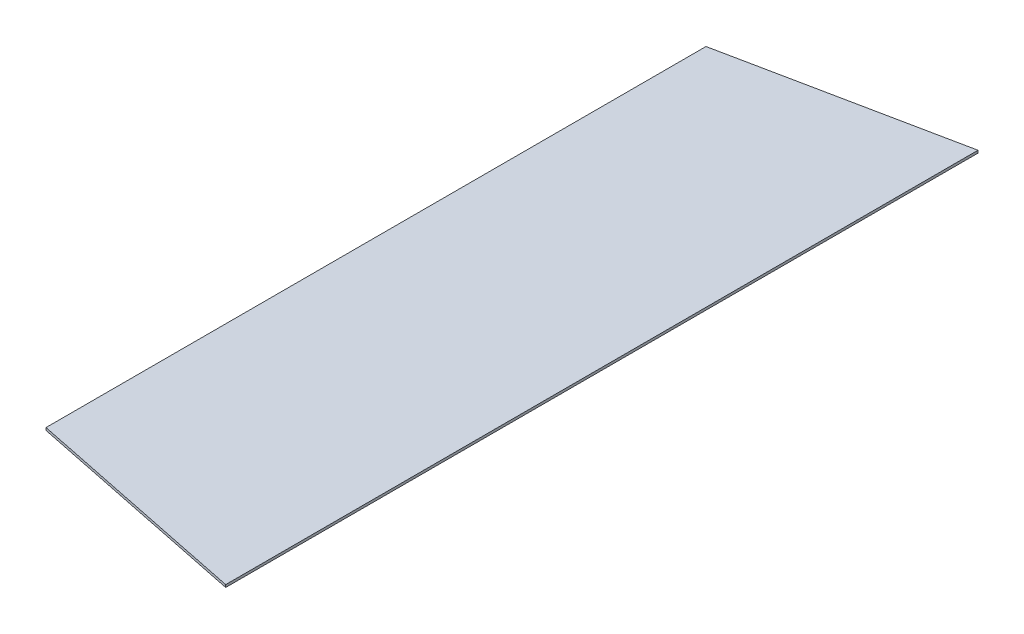
ISO-10303-21;
HEADER;
FILE_DESCRIPTION(('STEP AP214'),'2;1');
FILE_NAME('part.step','',(''),(''),'','','');
FILE_SCHEMA(('AUTOMOTIVE_DESIGN { 1 0 10303 214 1 1 1 1 }'));
ENDSEC;
DATA;
#1=APPLICATION_CONTEXT('core data for automotive mechanical design processes');
#2=APPLICATION_PROTOCOL_DEFINITION('international standard','automotive_design',2000,#1);
#3=PRODUCT_CONTEXT('',#1,'mechanical');
#4=PRODUCT('Part','Part','',(#3));
#5=PRODUCT_RELATED_PRODUCT_CATEGORY('part','',(#4));
#6=PRODUCT_DEFINITION_FORMATION('','',#4);
#7=PRODUCT_DEFINITION_CONTEXT('part definition',#1,'design');
#8=PRODUCT_DEFINITION('design','',#6,#7);
#9=PRODUCT_DEFINITION_SHAPE('','',#8);
#10=(LENGTH_UNIT() NAMED_UNIT(*) SI_UNIT(.MILLI.,.METRE.));
#11=(NAMED_UNIT(*) PLANE_ANGLE_UNIT() SI_UNIT($,.RADIAN.));
#12=(NAMED_UNIT(*) SI_UNIT($,.STERADIAN.) SOLID_ANGLE_UNIT());
#13=UNCERTAINTY_MEASURE_WITH_UNIT(LENGTH_MEASURE(1.E-05),#10,'distance_accuracy_value','');
#14=(GEOMETRIC_REPRESENTATION_CONTEXT(3) GLOBAL_UNCERTAINTY_ASSIGNED_CONTEXT((#13)) GLOBAL_UNIT_ASSIGNED_CONTEXT((#10,
#11,#12)) REPRESENTATION_CONTEXT('',''));
#15=CARTESIAN_POINT('',(0.,0.,0.));
#16=DIRECTION('',(0.,0.,1.));
#17=DIRECTION('',(1.,0.,0.));
#18=AXIS2_PLACEMENT_3D('',#15,#16,#17);
#19=CARTESIAN_POINT('',(-0.600000000000001,0.,1.49897790055249));
#20=DIRECTION('',(0.,1.,0.));
#21=DIRECTION('',(0.,0.,-1.));
#22=AXIS2_PLACEMENT_3D('',#19,#20,#21);
#23=PLANE('',#22);
#24=DIRECTION('',(0.979739078021312,0.,0.200278154070655));
#25=VECTOR('',#24,1.);
#26=CARTESIAN_POINT('',(-1.5,0.,1.315));
#27=LINE('',#26,#25);
#28=CARTESIAN_POINT('',(-1.5,0.,1.315));
#29=VERTEX_POINT('',#28);
#30=CARTESIAN_POINT('',(-0.600000000000001,0.,1.49897790055249));
#31=VERTEX_POINT('',#30);
#32=EDGE_CURVE('E11',#29,#31,#27,.T.);
#33=ORIENTED_EDGE('',*,*,#32,.T.);
#34=DIRECTION('',(0.,0.,-1.));
#35=VECTOR('',#34,1.);
#36=CARTESIAN_POINT('',(-0.600000000000001,0.,1.49897790055249));
#37=LINE('',#36,#35);
#38=CARTESIAN_POINT('',(-0.600000000000001,0.,-1.49897790055249));
#39=VERTEX_POINT('',#38);
#40=EDGE_CURVE('E61',#31,#39,#37,.T.);
#41=ORIENTED_EDGE('',*,*,#40,.T.);
#42=DIRECTION('',(-0.979739078021312,0.,0.200278154070655));
#43=VECTOR('',#42,1.);
#44=CARTESIAN_POINT('',(-0.6,0.,-1.49897790055249));
#45=LINE('',#44,#43);
#46=CARTESIAN_POINT('',(-1.5,0.,-1.315));
#47=VERTEX_POINT('',#46);
#48=EDGE_CURVE('E85',#39,#47,#45,.T.);
#49=ORIENTED_EDGE('',*,*,#48,.T.);
#50=DIRECTION('',(0.,0.,1.));
#51=VECTOR('',#50,1.);
#52=CARTESIAN_POINT('',(-1.5,0.,-1.315));
#53=LINE('',#52,#51);
#54=EDGE_CURVE('E24',#47,#29,#53,.T.);
#55=ORIENTED_EDGE('',*,*,#54,.T.);
#56=EDGE_LOOP('',(#33,#41,#49,#55));
#57=FACE_BOUND('',#56,.T.);
#58=ADVANCED_FACE('F17',(#57),#23,.T.);
#59=CARTESIAN_POINT('',(-1.5,0.29,-1.315));
#60=DIRECTION('',(1.,0.,0.));
#61=DIRECTION('',(0.,0.,-1.));
#62=AXIS2_PLACEMENT_3D('',#59,#60,#61);
#63=PLANE('',#62);
#64=ORIENTED_EDGE('',*,*,#54,.F.);
#65=DIRECTION('',(0.,-1.,0.));
#66=VECTOR('',#65,1.);
#67=CARTESIAN_POINT('',(-1.5,0.,-1.315));
#68=LINE('',#67,#66);
#69=CARTESIAN_POINT('',(-1.5,-0.0100000000000001,-1.315));
#70=VERTEX_POINT('',#69);
#71=EDGE_CURVE('E83',#47,#70,#68,.T.);
#72=ORIENTED_EDGE('',*,*,#71,.T.);
#73=DIRECTION('',(0.,0.,1.));
#74=VECTOR('',#73,1.);
#75=CARTESIAN_POINT('',(-1.5,-0.01,-1.315));
#76=LINE('',#75,#74);
#77=CARTESIAN_POINT('',(-1.5,-0.01,1.315));
#78=VERTEX_POINT('',#77);
#79=EDGE_CURVE('E79',#70,#78,#76,.T.);
#80=ORIENTED_EDGE('',*,*,#79,.T.);
#81=DIRECTION('',(0.,-1.,0.));
#82=VECTOR('',#81,1.);
#83=CARTESIAN_POINT('',(-1.5,0.,1.315));
#84=LINE('',#83,#82);
#85=EDGE_CURVE('E68',#29,#78,#84,.T.);
#86=ORIENTED_EDGE('',*,*,#85,.F.);
#87=EDGE_LOOP('',(#64,#72,#80,#86));
#88=FACE_BOUND('',#87,.T.);
#89=ADVANCED_FACE('F89',(#88),#63,.F.);
#90=CARTESIAN_POINT('',(-0.595,0.29,-1.5));
#91=DIRECTION('',(0.200278154070655,0.,0.979739078021312));
#92=DIRECTION('',(0.979739078021312,0.,-0.200278154070655));
#93=AXIS2_PLACEMENT_3D('',#90,#91,#92);
#94=PLANE('',#93);
#95=ORIENTED_EDGE('',*,*,#48,.F.);
#96=DIRECTION('',(0.,1.,0.));
#97=VECTOR('',#96,1.);
#98=CARTESIAN_POINT('',(-0.600000000000001,-0.01,-1.49897790055249));
#99=LINE('',#98,#97);
#100=CARTESIAN_POINT('',(-0.600000000000001,-0.01,-1.49897790055249));
#101=VERTEX_POINT('',#100);
#102=EDGE_CURVE('E81',#101,#39,#99,.T.);
#103=ORIENTED_EDGE('',*,*,#102,.F.);
#104=DIRECTION('',(0.979739078021194,0.,-0.200278154071234));
#105=VECTOR('',#104,1.);
#106=CARTESIAN_POINT('',(-1.5,-0.01,-1.315));
#107=LINE('',#106,#105);
#108=EDGE_CURVE('E71',#70,#101,#107,.T.);
#109=ORIENTED_EDGE('',*,*,#108,.F.);
#110=ORIENTED_EDGE('',*,*,#71,.F.);
#111=EDGE_LOOP('',(#95,#103,#109,#110));
#112=FACE_BOUND('',#111,.T.);
#113=ADVANCED_FACE('F91',(#112),#94,.F.);
#114=CARTESIAN_POINT('',(-1.5,0.29,1.315));
#115=DIRECTION('',(0.200278154070655,0.,-0.979739078021312));
#116=DIRECTION('',(-0.979739078021312,0.,-0.200278154070655));
#117=AXIS2_PLACEMENT_3D('',#114,#115,#116);
#118=PLANE('',#117);
#119=ORIENTED_EDGE('',*,*,#32,.F.);
#120=ORIENTED_EDGE('',*,*,#85,.T.);
#121=DIRECTION('',(-0.979739078021193,0.,-0.200278154071237));
#122=VECTOR('',#121,1.);
#123=CARTESIAN_POINT('',(-0.60000000000011,-0.01,1.49897790055302));
#124=LINE('',#123,#122);
#125=CARTESIAN_POINT('',(-0.600000000000001,-0.01,1.49897790055249));
#126=VERTEX_POINT('',#125);
#127=EDGE_CURVE('E63',#126,#78,#124,.T.);
#128=ORIENTED_EDGE('',*,*,#127,.F.);
#129=DIRECTION('',(0.,1.,0.));
#130=VECTOR('',#129,1.);
#131=CARTESIAN_POINT('',(-0.600000000000001,-0.01,1.49897790055249));
#132=LINE('',#131,#130);
#133=EDGE_CURVE('E54',#126,#31,#132,.T.);
#134=ORIENTED_EDGE('',*,*,#133,.T.);
#135=EDGE_LOOP('',(#119,#120,#128,#134));
#136=FACE_BOUND('',#135,.T.);
#137=ADVANCED_FACE('F67',(#136),#118,.F.);
#138=CARTESIAN_POINT('',(-0.600000000000001,-0.01,-1.49897790055249));
#139=DIRECTION('',(1.,0.,0.));
#140=DIRECTION('',(0.,0.,-1.));
#141=AXIS2_PLACEMENT_3D('',#138,#139,#140);
#142=PLANE('',#141);
#143=ORIENTED_EDGE('',*,*,#40,.F.);
#144=ORIENTED_EDGE('',*,*,#133,.F.);
#145=DIRECTION('',(0.,0.,-1.));
#146=VECTOR('',#145,1.);
#147=CARTESIAN_POINT('',(-0.600000000000001,-0.01,1.49897790055249));
#148=LINE('',#147,#146);
#149=EDGE_CURVE('E59',#126,#101,#148,.T.);
#150=ORIENTED_EDGE('',*,*,#149,.T.);
#151=ORIENTED_EDGE('',*,*,#102,.T.);
#152=EDGE_LOOP('',(#143,#144,#150,#151));
#153=FACE_BOUND('',#152,.T.);
#154=ADVANCED_FACE('F56',(#153),#142,.T.);
#155=CARTESIAN_POINT('',(0.,-0.01,0.));
#156=DIRECTION('',(0.,-1.,0.));
#157=DIRECTION('',(0.,0.,-1.));
#158=AXIS2_PLACEMENT_3D('',#155,#156,#157);
#159=PLANE('',#158);
#160=ORIENTED_EDGE('',*,*,#127,.T.);
#161=ORIENTED_EDGE('',*,*,#79,.F.);
#162=ORIENTED_EDGE('',*,*,#108,.T.);
#163=ORIENTED_EDGE('',*,*,#149,.F.);
#164=EDGE_LOOP('',(#160,#161,#162,#163));
#165=FACE_BOUND('',#164,.T.);
#166=ADVANCED_FACE('F73',(#165),#159,.T.);
#167=CLOSED_SHELL('',(#58,#89,#113,#137,#154,#166));
#168=MANIFOLD_SOLID_BREP('B1',#167);
#169=ADVANCED_BREP_SHAPE_REPRESENTATION('',(#18,#168),#14);
#170=SHAPE_DEFINITION_REPRESENTATION(#9,#169);
ENDSEC;
END-ISO-10303-21;
